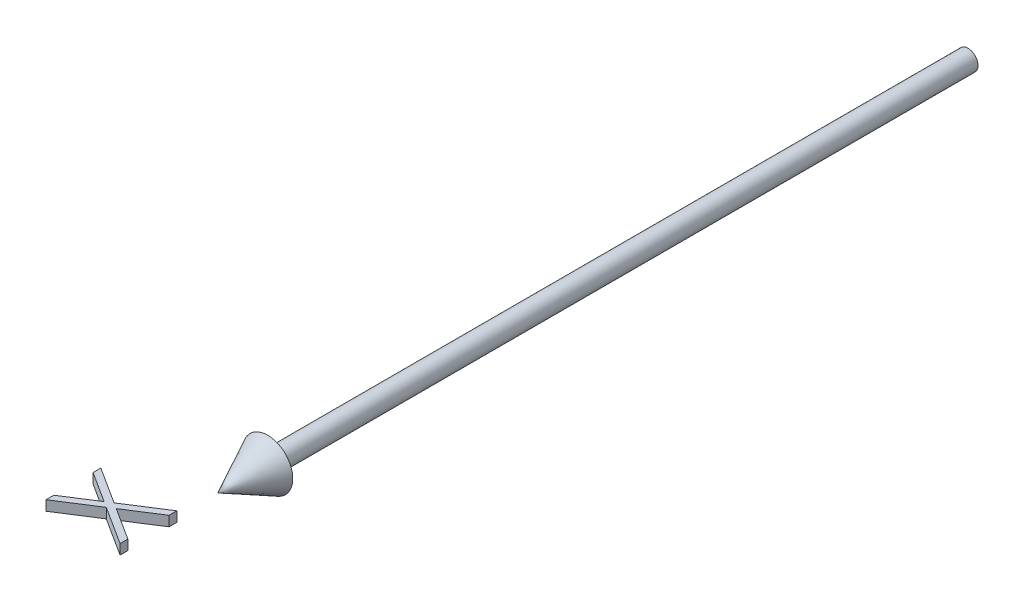
ISO-10303-21;
HEADER;
FILE_DESCRIPTION(('STEP AP214'),'2;1');
FILE_NAME('part.step','',(''),(''),'','','');
FILE_SCHEMA(('AUTOMOTIVE_DESIGN { 1 0 10303 214 1 1 1 1 }'));
ENDSEC;
DATA;
#1=APPLICATION_CONTEXT('core data for automotive mechanical design processes');
#2=APPLICATION_PROTOCOL_DEFINITION('international standard','automotive_design',2000,#1);
#3=PRODUCT_CONTEXT('',#1,'mechanical');
#4=PRODUCT('Part','Part','',(#3));
#5=PRODUCT_RELATED_PRODUCT_CATEGORY('part','',(#4));
#6=PRODUCT_DEFINITION_FORMATION('','',#4);
#7=PRODUCT_DEFINITION_CONTEXT('part definition',#1,'design');
#8=PRODUCT_DEFINITION('design','',#6,#7);
#9=PRODUCT_DEFINITION_SHAPE('','',#8);
#10=(LENGTH_UNIT() NAMED_UNIT(*) SI_UNIT(.MILLI.,.METRE.));
#11=(NAMED_UNIT(*) PLANE_ANGLE_UNIT() SI_UNIT($,.RADIAN.));
#12=(NAMED_UNIT(*) SI_UNIT($,.STERADIAN.) SOLID_ANGLE_UNIT());
#13=UNCERTAINTY_MEASURE_WITH_UNIT(LENGTH_MEASURE(1.E-05),#10,'distance_accuracy_value','');
#14=(GEOMETRIC_REPRESENTATION_CONTEXT(3) GLOBAL_UNCERTAINTY_ASSIGNED_CONTEXT((#13)) GLOBAL_UNIT_ASSIGNED_CONTEXT((#10,
#11,#12)) REPRESENTATION_CONTEXT('',''));
#15=CARTESIAN_POINT('',(0.,0.,0.));
#16=DIRECTION('',(0.,0.,1.));
#17=DIRECTION('',(1.,0.,0.));
#18=AXIS2_PLACEMENT_3D('',#15,#16,#17);
#19=CARTESIAN_POINT('',(-7.65024038461539,1.00000000000005,163.070913461538));
#20=DIRECTION('',(-0.539190475611023,0.,0.842183846324755));
#21=DIRECTION('',(0.842183846324755,0.,0.539190475611023));
#22=AXIS2_PLACEMENT_3D('',#19,#20,#21);
#23=PLANE('',#22);
#24=DIRECTION('',(0.,-1.,0.));
#25=VECTOR('',#24,1.);
#26=CARTESIAN_POINT('',(-7.65024038461539,1.00000000000005,163.070913461538));
#27=LINE('',#26,#25);
#28=CARTESIAN_POINT('',(-7.65024038461539,1.00000000000005,163.070913461538));
#29=VERTEX_POINT('',#28);
#30=CARTESIAN_POINT('',(-7.65024038461539,-0.999999999999947,163.070913461538));
#31=VERTEX_POINT('',#30);
#32=EDGE_CURVE('E155',#29,#31,#27,.T.);
#33=ORIENTED_EDGE('',*,*,#32,.T.);
#34=DIRECTION('',(-0.842183846324755,0.,-0.539190475611023));
#35=VECTOR('',#34,1.);
#36=CARTESIAN_POINT('',(-7.65024038461539,-0.999999999999947,163.070913461538));
#37=LINE('',#36,#35);
#38=CARTESIAN_POINT('',(-15.,-0.999999999999895,158.365384615385));
#39=VERTEX_POINT('',#38);
#40=EDGE_CURVE('E149',#31,#39,#37,.T.);
#41=ORIENTED_EDGE('',*,*,#40,.T.);
#42=DIRECTION('',(0.,-1.,0.));
#43=VECTOR('',#42,1.);
#44=CARTESIAN_POINT('',(-15.,1.0000000000001,158.365384615385));
#45=LINE('',#44,#43);
#46=CARTESIAN_POINT('',(-15.,1.0000000000001,158.365384615385));
#47=VERTEX_POINT('',#46);
#48=EDGE_CURVE('E12',#47,#39,#45,.T.);
#49=ORIENTED_EDGE('',*,*,#48,.F.);
#50=DIRECTION('',(-0.842183846324755,0.,-0.539190475611023));
#51=VECTOR('',#50,1.);
#52=CARTESIAN_POINT('',(-7.65024038461539,1.00000000000005,163.070913461538));
#53=LINE('',#52,#51);
#54=EDGE_CURVE('E185',#29,#47,#53,.T.);
#55=ORIENTED_EDGE('',*,*,#54,.F.);
#56=EDGE_LOOP('',(#33,#41,#49,#55));
#57=FACE_BOUND('',#56,.T.);
#58=ADVANCED_FACE('F49',(#57),#23,.F.);
#59=CARTESIAN_POINT('',(-15.,1.0000000000001,158.365384615385));
#60=DIRECTION('',(1.,0.,0.));
#61=DIRECTION('',(0.,0.,-1.));
#62=AXIS2_PLACEMENT_3D('',#59,#60,#61);
#63=PLANE('',#62);
#64=ORIENTED_EDGE('',*,*,#48,.T.);
#65=DIRECTION('',(0.,0.,1.));
#66=VECTOR('',#65,1.);
#67=CARTESIAN_POINT('',(-15.,-0.999999999999895,158.365384615385));
#68=LINE('',#67,#66);
#69=CARTESIAN_POINT('',(-15.,-0.999999999999895,159.918870192308));
#70=VERTEX_POINT('',#69);
#71=EDGE_CURVE('E139',#39,#70,#68,.T.);
#72=ORIENTED_EDGE('',*,*,#71,.T.);
#73=DIRECTION('',(0.,-1.,0.));
#74=VECTOR('',#73,1.);
#75=CARTESIAN_POINT('',(-15.,1.0000000000001,159.918870192308));
#76=LINE('',#75,#74);
#77=CARTESIAN_POINT('',(-15.,1.0000000000001,159.918870192308));
#78=VERTEX_POINT('',#77);
#79=EDGE_CURVE('E56',#78,#70,#76,.T.);
#80=ORIENTED_EDGE('',*,*,#79,.F.);
#81=DIRECTION('',(0.,0.,1.));
#82=VECTOR('',#81,1.);
#83=CARTESIAN_POINT('',(-15.,1.0000000000001,158.365384615385));
#84=LINE('',#83,#82);
#85=EDGE_CURVE('E140',#47,#78,#84,.T.);
#86=ORIENTED_EDGE('',*,*,#85,.F.);
#87=EDGE_LOOP('',(#64,#72,#80,#86));
#88=FACE_BOUND('',#87,.T.);
#89=ADVANCED_FACE('F137',(#88),#63,.F.);
#90=CARTESIAN_POINT('',(-15.,1.0000000000001,159.918870192308));
#91=DIRECTION('',(0.53908880912856,0.,-0.842248927498487));
#92=DIRECTION('',(-0.842248927498487,0.,-0.53908880912856));
#93=AXIS2_PLACEMENT_3D('',#90,#91,#92);
#94=PLANE('',#93);
#95=ORIENTED_EDGE('',*,*,#79,.T.);
#96=DIRECTION('',(0.842248927498486,0.,0.53908880912856));
#97=VECTOR('',#96,1.);
#98=CARTESIAN_POINT('',(-15.,-0.999999999999895,159.918870192308));
#99=LINE('',#98,#97);
#100=CARTESIAN_POINT('',(-8.86418269230769,-0.999999999999938,163.846153846154));
#101=VERTEX_POINT('',#100);
#102=EDGE_CURVE('E153',#70,#101,#99,.T.);
#103=ORIENTED_EDGE('',*,*,#102,.T.);
#104=DIRECTION('',(0.,-1.,0.));
#105=VECTOR('',#104,1.);
#106=CARTESIAN_POINT('',(-8.86418269230769,1.00000000000006,163.846153846154));
#107=LINE('',#106,#105);
#108=CARTESIAN_POINT('',(-8.86418269230769,1.00000000000006,163.846153846154));
#109=VERTEX_POINT('',#108);
#110=EDGE_CURVE('E223',#109,#101,#107,.T.);
#111=ORIENTED_EDGE('',*,*,#110,.F.);
#112=DIRECTION('',(0.842248927498486,0.,0.53908880912856));
#113=VECTOR('',#112,1.);
#114=CARTESIAN_POINT('',(-15.,1.0000000000001,159.918870192308));
#115=LINE('',#114,#113);
#116=EDGE_CURVE('E188',#78,#109,#115,.T.);
#117=ORIENTED_EDGE('',*,*,#116,.F.);
#118=EDGE_LOOP('',(#95,#103,#111,#117));
#119=FACE_BOUND('',#118,.T.);
#120=ADVANCED_FACE('F226',(#119),#94,.F.);
#121=CARTESIAN_POINT('',(-8.86418269230769,1.00000000000006,163.846153846154));
#122=DIRECTION('',(0.539088809128563,0.,0.842248927498485));
#123=DIRECTION('',(0.842248927498485,0.,-0.539088809128563));
#124=AXIS2_PLACEMENT_3D('',#121,#122,#123);
#125=PLANE('',#124);
#126=ORIENTED_EDGE('',*,*,#110,.T.);
#127=DIRECTION('',(-0.842248927498485,0.,0.539088809128563));
#128=VECTOR('',#127,1.);
#129=CARTESIAN_POINT('',(-8.86418269230769,-0.999999999999938,163.846153846154));
#130=LINE('',#129,#128);
#131=CARTESIAN_POINT('',(-15.,-0.999999999999895,167.7734375));
#132=VERTEX_POINT('',#131);
#133=EDGE_CURVE('E159',#101,#132,#130,.T.);
#134=ORIENTED_EDGE('',*,*,#133,.T.);
#135=DIRECTION('',(0.,-1.,0.));
#136=VECTOR('',#135,1.);
#137=CARTESIAN_POINT('',(-15.,1.0000000000001,167.7734375));
#138=LINE('',#137,#136);
#139=CARTESIAN_POINT('',(-15.,1.0000000000001,167.7734375));
#140=VERTEX_POINT('',#139);
#141=EDGE_CURVE('E221',#140,#132,#138,.T.);
#142=ORIENTED_EDGE('',*,*,#141,.F.);
#143=DIRECTION('',(-0.842248927498485,0.,0.539088809128563));
#144=VECTOR('',#143,1.);
#145=CARTESIAN_POINT('',(-8.86418269230769,1.00000000000006,163.846153846154));
#146=LINE('',#145,#144);
#147=EDGE_CURVE('E190',#109,#140,#146,.T.);
#148=ORIENTED_EDGE('',*,*,#147,.F.);
#149=EDGE_LOOP('',(#126,#134,#142,#148));
#150=FACE_BOUND('',#149,.T.);
#151=ADVANCED_FACE('F234',(#150),#125,.F.);
#152=CARTESIAN_POINT('',(-15.,1.0000000000001,167.7734375));
#153=DIRECTION('',(1.,0.,0.));
#154=DIRECTION('',(0.,0.,-1.));
#155=AXIS2_PLACEMENT_3D('',#152,#153,#154);
#156=PLANE('',#155);
#157=ORIENTED_EDGE('',*,*,#141,.T.);
#158=DIRECTION('',(0.,0.,1.));
#159=VECTOR('',#158,1.);
#160=CARTESIAN_POINT('',(-15.,-0.999999999999895,167.7734375));
#161=LINE('',#160,#159);
#162=CARTESIAN_POINT('',(-15.,-0.999999999999895,169.326923076923));
#163=VERTEX_POINT('',#162);
#164=EDGE_CURVE('E162',#132,#163,#161,.T.);
#165=ORIENTED_EDGE('',*,*,#164,.T.);
#166=DIRECTION('',(0.,-1.,0.));
#167=VECTOR('',#166,1.);
#168=CARTESIAN_POINT('',(-15.,1.0000000000001,169.326923076923));
#169=LINE('',#168,#167);
#170=CARTESIAN_POINT('',(-15.,1.0000000000001,169.326923076923));
#171=VERTEX_POINT('',#170);
#172=EDGE_CURVE('E219',#171,#163,#169,.T.);
#173=ORIENTED_EDGE('',*,*,#172,.F.);
#174=DIRECTION('',(0.,0.,1.));
#175=VECTOR('',#174,1.);
#176=CARTESIAN_POINT('',(-15.,1.0000000000001,167.7734375));
#177=LINE('',#176,#175);
#178=EDGE_CURVE('E192',#140,#171,#177,.T.);
#179=ORIENTED_EDGE('',*,*,#178,.F.);
#180=EDGE_LOOP('',(#157,#165,#173,#179));
#181=FACE_BOUND('',#180,.T.);
#182=ADVANCED_FACE('F237',(#181),#156,.F.);
#183=CARTESIAN_POINT('',(-15.,1.0000000000001,169.326923076923));
#184=DIRECTION('',(-0.538946197134425,0.,-0.842340190537257));
#185=DIRECTION('',(-0.842340190537257,0.,0.538946197134425));
#186=AXIS2_PLACEMENT_3D('',#183,#184,#185);
#187=PLANE('',#186);
#188=ORIENTED_EDGE('',*,*,#172,.T.);
#189=DIRECTION('',(0.842340190537257,0.,-0.538946197134425));
#190=VECTOR('',#189,1.);
#191=CARTESIAN_POINT('',(-15.,-0.999999999999895,169.326923076923));
#192=LINE('',#191,#190);
#193=CARTESIAN_POINT('',(-7.65024038461539,-0.999999999999947,164.624399038462));
#194=VERTEX_POINT('',#193);
#195=EDGE_CURVE('E165',#163,#194,#192,.T.);
#196=ORIENTED_EDGE('',*,*,#195,.T.);
#197=DIRECTION('',(0.,-1.,0.));
#198=VECTOR('',#197,1.);
#199=CARTESIAN_POINT('',(-7.65024038461539,1.00000000000005,164.624399038462));
#200=LINE('',#199,#198);
#201=CARTESIAN_POINT('',(-7.65024038461539,1.00000000000005,164.624399038462));
#202=VERTEX_POINT('',#201);
#203=EDGE_CURVE('E217',#202,#194,#200,.T.);
#204=ORIENTED_EDGE('',*,*,#203,.F.);
#205=DIRECTION('',(0.842340190537257,0.,-0.538946197134425));
#206=VECTOR('',#205,1.);
#207=CARTESIAN_POINT('',(-15.,1.0000000000001,169.326923076923));
#208=LINE('',#207,#206);
#209=EDGE_CURVE('E194',#171,#202,#208,.T.);
#210=ORIENTED_EDGE('',*,*,#209,.F.);
#211=EDGE_LOOP('',(#188,#196,#204,#210));
#212=FACE_BOUND('',#211,.T.);
#213=ADVANCED_FACE('F242',(#212),#187,.F.);
#214=CARTESIAN_POINT('',(-7.65024038461539,1.00000000000005,164.624399038462));
#215=DIRECTION('',(0.538950419912938,0.,-0.842337488703707));
#216=DIRECTION('',(-0.842337488703707,0.,-0.538950419912938));
#217=AXIS2_PLACEMENT_3D('',#214,#215,#216);
#218=PLANE('',#217);
#219=ORIENTED_EDGE('',*,*,#203,.T.);
#220=DIRECTION('',(0.842337488703707,0.,0.538950419912938));
#221=VECTOR('',#220,1.);
#222=CARTESIAN_POINT('',(-7.65024038461539,-0.999999999999947,164.624399038462));
#223=LINE('',#222,#221);
#224=CARTESIAN_POINT('',(0.,-1.,169.519230769231));
#225=VERTEX_POINT('',#224);
#226=EDGE_CURVE('E168',#194,#225,#223,.T.);
#227=ORIENTED_EDGE('',*,*,#226,.T.);
#228=DIRECTION('',(0.,-1.,0.));
#229=VECTOR('',#228,1.);
#230=CARTESIAN_POINT('',(0.,1.,169.519230769231));
#231=LINE('',#230,#229);
#232=CARTESIAN_POINT('',(0.,1.,169.519230769231));
#233=VERTEX_POINT('',#232);
#234=EDGE_CURVE('E215',#233,#225,#231,.T.);
#235=ORIENTED_EDGE('',*,*,#234,.F.);
#236=DIRECTION('',(0.842337488703707,0.,0.538950419912938));
#237=VECTOR('',#236,1.);
#238=CARTESIAN_POINT('',(-7.65024038461539,1.00000000000005,164.624399038462));
#239=LINE('',#238,#237);
#240=EDGE_CURVE('E196',#202,#233,#239,.T.);
#241=ORIENTED_EDGE('',*,*,#240,.F.);
#242=EDGE_LOOP('',(#219,#227,#235,#241));
#243=FACE_BOUND('',#242,.T.);
#244=ADVANCED_FACE('F248',(#243),#218,.F.);
#245=CARTESIAN_POINT('',(0.,1.,169.519230769231));
#246=DIRECTION('',(-1.,0.,0.));
#247=DIRECTION('',(0.,0.,1.));
#248=AXIS2_PLACEMENT_3D('',#245,#246,#247);
#249=PLANE('',#248);
#250=ORIENTED_EDGE('',*,*,#234,.T.);
#251=DIRECTION('',(0.,0.,-1.));
#252=VECTOR('',#251,1.);
#253=CARTESIAN_POINT('',(0.,-1.,169.519230769231));
#254=LINE('',#253,#252);
#255=CARTESIAN_POINT('',(0.,-1.,167.965745192308));
#256=VERTEX_POINT('',#255);
#257=EDGE_CURVE('E171',#225,#256,#254,.T.);
#258=ORIENTED_EDGE('',*,*,#257,.T.);
#259=DIRECTION('',(0.,-1.,0.));
#260=VECTOR('',#259,1.);
#261=CARTESIAN_POINT('',(0.,1.,167.965745192308));
#262=LINE('',#261,#260);
#263=CARTESIAN_POINT('',(0.,1.,167.965745192308));
#264=VERTEX_POINT('',#263);
#265=EDGE_CURVE('E213',#264,#256,#262,.T.);
#266=ORIENTED_EDGE('',*,*,#265,.F.);
#267=DIRECTION('',(0.,0.,-1.));
#268=VECTOR('',#267,1.);
#269=CARTESIAN_POINT('',(0.,1.,169.519230769231));
#270=LINE('',#269,#268);
#271=EDGE_CURVE('E198',#233,#264,#270,.T.);
#272=ORIENTED_EDGE('',*,*,#271,.F.);
#273=EDGE_LOOP('',(#250,#258,#266,#272));
#274=FACE_BOUND('',#273,.T.);
#275=ADVANCED_FACE('F252',(#274),#249,.F.);
#276=CARTESIAN_POINT('',(0.,1.,167.965745192308));
#277=DIRECTION('',(-0.539087169942498,0.,0.842249976671646));
#278=DIRECTION('',(0.842249976671646,0.,0.539087169942498));
#279=AXIS2_PLACEMENT_3D('',#276,#277,#278);
#280=PLANE('',#279);
#281=ORIENTED_EDGE('',*,*,#265,.T.);
#282=DIRECTION('',(-0.842249976671646,0.,-0.539087169942498));
#283=VECTOR('',#282,1.);
#284=CARTESIAN_POINT('',(0.,-1.,167.965745192308));
#285=LINE('',#284,#283);
#286=CARTESIAN_POINT('',(-6.43629807692308,-0.999999999999955,163.846153846154));
#287=VERTEX_POINT('',#286);
#288=EDGE_CURVE('E174',#256,#287,#285,.T.);
#289=ORIENTED_EDGE('',*,*,#288,.T.);
#290=DIRECTION('',(0.,-1.,0.));
#291=VECTOR('',#290,1.);
#292=CARTESIAN_POINT('',(-6.43629807692308,1.00000000000004,163.846153846154));
#293=LINE('',#292,#291);
#294=CARTESIAN_POINT('',(-6.43629807692308,1.00000000000004,163.846153846154));
#295=VERTEX_POINT('',#294);
#296=EDGE_CURVE('E211',#295,#287,#293,.T.);
#297=ORIENTED_EDGE('',*,*,#296,.F.);
#298=DIRECTION('',(-0.842249976671646,0.,-0.539087169942498));
#299=VECTOR('',#298,1.);
#300=CARTESIAN_POINT('',(0.,1.,167.965745192308));
#301=LINE('',#300,#299);
#302=EDGE_CURVE('E200',#264,#295,#301,.T.);
#303=ORIENTED_EDGE('',*,*,#302,.F.);
#304=EDGE_LOOP('',(#281,#289,#297,#303));
#305=FACE_BOUND('',#304,.T.);
#306=ADVANCED_FACE('F257',(#305),#280,.F.);
#307=CARTESIAN_POINT('',(-6.43629807692308,1.00000000000004,163.846153846154));
#308=DIRECTION('',(-0.539087169942496,0.,-0.842249976671648));
#309=DIRECTION('',(-0.842249976671648,0.,0.539087169942496));
#310=AXIS2_PLACEMENT_3D('',#307,#308,#309);
#311=PLANE('',#310);
#312=ORIENTED_EDGE('',*,*,#296,.T.);
#313=DIRECTION('',(0.842249976671648,0.,-0.539087169942496));
#314=VECTOR('',#313,1.);
#315=CARTESIAN_POINT('',(-6.43629807692308,-0.999999999999955,163.846153846154));
#316=LINE('',#315,#314);
#317=CARTESIAN_POINT('',(0.,-1.,159.7265625));
#318=VERTEX_POINT('',#317);
#319=EDGE_CURVE('E177',#287,#318,#316,.T.);
#320=ORIENTED_EDGE('',*,*,#319,.T.);
#321=DIRECTION('',(0.,-1.,0.));
#322=VECTOR('',#321,1.);
#323=CARTESIAN_POINT('',(0.,1.,159.7265625));
#324=LINE('',#323,#322);
#325=CARTESIAN_POINT('',(0.,1.,159.7265625));
#326=VERTEX_POINT('',#325);
#327=EDGE_CURVE('E209',#326,#318,#324,.T.);
#328=ORIENTED_EDGE('',*,*,#327,.F.);
#329=DIRECTION('',(0.842249976671648,0.,-0.539087169942496));
#330=VECTOR('',#329,1.);
#331=CARTESIAN_POINT('',(-6.43629807692308,1.00000000000004,163.846153846154));
#332=LINE('',#331,#330);
#333=EDGE_CURVE('E202',#295,#326,#332,.T.);
#334=ORIENTED_EDGE('',*,*,#333,.F.);
#335=EDGE_LOOP('',(#312,#320,#328,#334));
#336=FACE_BOUND('',#335,.T.);
#337=ADVANCED_FACE('F261',(#336),#311,.F.);
#338=CARTESIAN_POINT('',(0.,1.,159.7265625));
#339=DIRECTION('',(-1.,0.,0.));
#340=DIRECTION('',(0.,0.,1.));
#341=AXIS2_PLACEMENT_3D('',#338,#339,#340);
#342=PLANE('',#341);
#343=ORIENTED_EDGE('',*,*,#327,.T.);
#344=DIRECTION('',(0.,0.,-1.));
#345=VECTOR('',#344,1.);
#346=CARTESIAN_POINT('',(0.,-1.,159.7265625));
#347=LINE('',#346,#345);
#348=CARTESIAN_POINT('',(0.,-1.,158.173076923077));
#349=VERTEX_POINT('',#348);
#350=EDGE_CURVE('E180',#318,#349,#347,.T.);
#351=ORIENTED_EDGE('',*,*,#350,.T.);
#352=DIRECTION('',(0.,-1.,0.));
#353=VECTOR('',#352,1.);
#354=CARTESIAN_POINT('',(0.,1.,158.173076923077));
#355=LINE('',#354,#353);
#356=CARTESIAN_POINT('',(0.,1.,158.173076923077));
#357=VERTEX_POINT('',#356);
#358=EDGE_CURVE('E207',#357,#349,#355,.T.);
#359=ORIENTED_EDGE('',*,*,#358,.F.);
#360=DIRECTION('',(0.,0.,-1.));
#361=VECTOR('',#360,1.);
#362=CARTESIAN_POINT('',(0.,1.,159.7265625));
#363=LINE('',#362,#361);
#364=EDGE_CURVE('E68',#326,#357,#363,.T.);
#365=ORIENTED_EDGE('',*,*,#364,.F.);
#366=EDGE_LOOP('',(#343,#351,#359,#365));
#367=FACE_BOUND('',#366,.T.);
#368=ADVANCED_FACE('F265',(#367),#342,.F.);
#369=CARTESIAN_POINT('',(0.,1.,158.173076923077));
#370=DIRECTION('',(0.539185104098949,0.,0.842187285298113));
#371=DIRECTION('',(0.842187285298113,0.,-0.539185104098949));
#372=AXIS2_PLACEMENT_3D('',#369,#370,#371);
#373=PLANE('',#372);
#374=ORIENTED_EDGE('',*,*,#358,.T.);
#375=DIRECTION('',(-0.842187285298113,0.,0.539185104098949));
#376=VECTOR('',#375,1.);
#377=CARTESIAN_POINT('',(0.,-1.,158.173076923077));
#378=LINE('',#377,#376);
#379=EDGE_CURVE('E183',#349,#31,#378,.T.);
#380=ORIENTED_EDGE('',*,*,#379,.T.);
#381=ORIENTED_EDGE('',*,*,#32,.F.);
#382=DIRECTION('',(-0.842187285298113,0.,0.539185104098949));
#383=VECTOR('',#382,1.);
#384=CARTESIAN_POINT('',(0.,1.,158.173076923077));
#385=LINE('',#384,#383);
#386=EDGE_CURVE('E63',#357,#29,#385,.T.);
#387=ORIENTED_EDGE('',*,*,#386,.F.);
#388=EDGE_LOOP('',(#374,#380,#381,#387));
#389=FACE_BOUND('',#388,.T.);
#390=ADVANCED_FACE('F267',(#389),#373,.F.);
#391=CARTESIAN_POINT('',(0.,1.,0.));
#392=DIRECTION('',(0.,1.,0.));
#393=DIRECTION('',(-1.,0.,0.));
#394=AXIS2_PLACEMENT_3D('',#391,#392,#393);
#395=PLANE('',#394);
#396=ORIENTED_EDGE('',*,*,#54,.T.);
#397=ORIENTED_EDGE('',*,*,#85,.T.);
#398=ORIENTED_EDGE('',*,*,#116,.T.);
#399=ORIENTED_EDGE('',*,*,#147,.T.);
#400=ORIENTED_EDGE('',*,*,#178,.T.);
#401=ORIENTED_EDGE('',*,*,#209,.T.);
#402=ORIENTED_EDGE('',*,*,#240,.T.);
#403=ORIENTED_EDGE('',*,*,#271,.T.);
#404=ORIENTED_EDGE('',*,*,#302,.T.);
#405=ORIENTED_EDGE('',*,*,#333,.T.);
#406=ORIENTED_EDGE('',*,*,#364,.T.);
#407=ORIENTED_EDGE('',*,*,#386,.T.);
#408=EDGE_LOOP('',(#396,#397,#398,#399,#400,#401,#402,#403,#404,#405,#406,#407));
#409=FACE_BOUND('',#408,.T.);
#410=ADVANCED_FACE('F229',(#409),#395,.T.);
#411=CARTESIAN_POINT('',(0.,-1.,0.));
#412=DIRECTION('',(0.,1.,0.));
#413=DIRECTION('',(-1.,0.,0.));
#414=AXIS2_PLACEMENT_3D('',#411,#412,#413);
#415=PLANE('',#414);
#416=ORIENTED_EDGE('',*,*,#40,.F.);
#417=ORIENTED_EDGE('',*,*,#379,.F.);
#418=ORIENTED_EDGE('',*,*,#350,.F.);
#419=ORIENTED_EDGE('',*,*,#319,.F.);
#420=ORIENTED_EDGE('',*,*,#288,.F.);
#421=ORIENTED_EDGE('',*,*,#257,.F.);
#422=ORIENTED_EDGE('',*,*,#226,.F.);
#423=ORIENTED_EDGE('',*,*,#195,.F.);
#424=ORIENTED_EDGE('',*,*,#164,.F.);
#425=ORIENTED_EDGE('',*,*,#133,.F.);
#426=ORIENTED_EDGE('',*,*,#102,.F.);
#427=ORIENTED_EDGE('',*,*,#71,.F.);
#428=EDGE_LOOP('',(#416,#417,#418,#419,#420,#421,#422,#423,#424,#425,#426,#427));
#429=FACE_BOUND('',#428,.T.);
#430=ADVANCED_FACE('F147',(#429),#415,.F.);
#431=CLOSED_SHELL('',(#58,#89,#120,#151,#182,#213,#244,#275,#306,#337,#368,#390,#410,#430));
#432=MANIFOLD_SOLID_BREP('B2',#431);
#433=CARTESIAN_POINT('',(2.,0.,0.));
#434=DIRECTION('',(0.,0.,1.));
#435=DIRECTION('',(1.,0.,0.));
#436=AXIS2_PLACEMENT_3D('',#433,#434,#435);
#437=PLANE('',#436);
#438=CARTESIAN_POINT('',(0.,0.,0.));
#439=DIRECTION('',(0.,0.,-1.));
#440=DIRECTION('',(-1.,0.,0.));
#441=AXIS2_PLACEMENT_3D('',#438,#439,#440);
#442=CIRCLE('',#441,2.);
#443=CARTESIAN_POINT('',(-2.,0.,0.));
#444=VERTEX_POINT('',#443);
#445=EDGE_CURVE('E47',#444,#444,#442,.T.);
#446=ORIENTED_EDGE('',*,*,#445,.T.);
#447=EDGE_LOOP('',(#446));
#448=FACE_BOUND('',#447,.T.);
#449=ADVANCED_FACE('F381',(#448),#437,.F.);
#450=CARTESIAN_POINT('',(0.,0.,-41.9499520246458));
#451=DIRECTION('',(0.,0.,-1.));
#452=DIRECTION('',(-1.,0.,0.));
#453=AXIS2_PLACEMENT_3D('',#450,#451,#452);
#454=CYLINDRICAL_SURFACE('',#453,2.);
#455=ORIENTED_EDGE('',*,*,#445,.F.);
#456=EDGE_LOOP('',(#455));
#457=FACE_BOUND('',#456,.T.);
#458=CARTESIAN_POINT('',(0.,0.,140.));
#459=DIRECTION('',(0.,0.,-1.));
#460=DIRECTION('',(-1.,0.,0.));
#461=AXIS2_PLACEMENT_3D('',#458,#459,#460);
#462=CIRCLE('',#461,2.);
#463=CARTESIAN_POINT('',(-2.,0.,140.));
#464=VERTEX_POINT('',#463);
#465=EDGE_CURVE('E387',#464,#464,#462,.T.);
#466=ORIENTED_EDGE('',*,*,#465,.T.);
#467=EDGE_LOOP('',(#466));
#468=FACE_BOUND('',#467,.T.);
#469=ADVANCED_FACE('F398',(#457,#468),#454,.T.);
#470=CARTESIAN_POINT('',(5.00000000000002,0.,140.));
#471=DIRECTION('',(0.,0.,1.));
#472=DIRECTION('',(1.,0.,0.));
#473=AXIS2_PLACEMENT_3D('',#470,#471,#472);
#474=PLANE('',#473);
#475=ORIENTED_EDGE('',*,*,#465,.F.);
#476=EDGE_LOOP('',(#475));
#477=FACE_BOUND('',#476,.T.);
#478=CARTESIAN_POINT('',(0.,0.,140.));
#479=DIRECTION('',(0.,0.,-1.));
#480=DIRECTION('',(-1.,0.,0.));
#481=AXIS2_PLACEMENT_3D('',#478,#479,#480);
#482=CIRCLE('',#481,5.00000000000002);
#483=CARTESIAN_POINT('',(-5.00000000000002,0.,140.));
#484=VERTEX_POINT('',#483);
#485=EDGE_CURVE('E412',#484,#484,#482,.T.);
#486=ORIENTED_EDGE('',*,*,#485,.T.);
#487=EDGE_LOOP('',(#486));
#488=FACE_BOUND('',#487,.T.);
#489=ADVANCED_FACE('F392',(#477,#488),#474,.F.);
#490=CARTESIAN_POINT('',(0.,0.,150.));
#491=DIRECTION('',(0.,0.,-1.));
#492=DIRECTION('',(-1.,0.,0.));
#493=AXIS2_PLACEMENT_3D('',#490,#491,#492);
#494=CONICAL_SURFACE('',#493,0.,0.463647609000806);
#495=ORIENTED_EDGE('',*,*,#485,.F.);
#496=EDGE_LOOP('',(#495));
#497=FACE_BOUND('',#496,.T.);
#498=CARTESIAN_POINT('',(0.,0.,150.));
#499=VERTEX_POINT('',#498);
#500=VERTEX_LOOP('',#499);
#501=FACE_BOUND('',#500,.T.);
#502=ADVANCED_FACE('F390',(#497,#501),#494,.T.);
#503=CLOSED_SHELL('',(#449,#469,#489,#502));
#504=MANIFOLD_SOLID_BREP('B6',#503);
#505=ADVANCED_BREP_SHAPE_REPRESENTATION('',(#18,#432,#504),#14);
#506=SHAPE_DEFINITION_REPRESENTATION(#9,#505);
ENDSEC;
END-ISO-10303-21;
